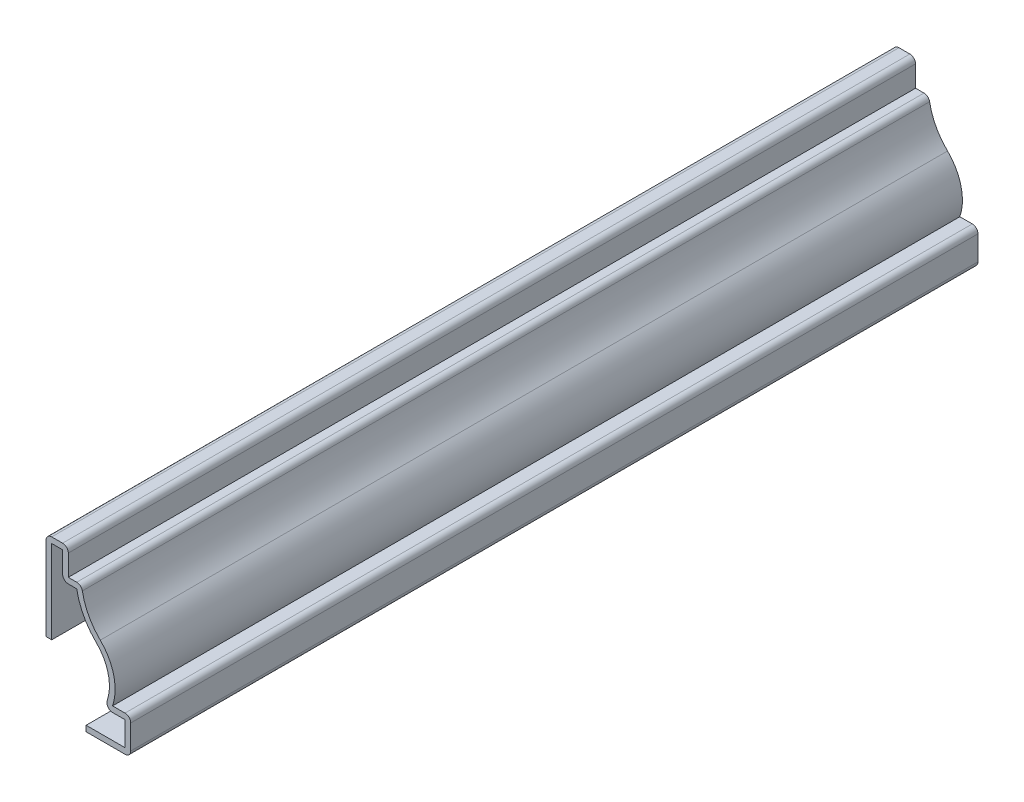
ISO-10303-21;
HEADER;
FILE_DESCRIPTION(('STEP AP214'),'2;1');
FILE_NAME('part.step','',(''),(''),'','','');
FILE_SCHEMA(('AUTOMOTIVE_DESIGN { 1 0 10303 214 1 1 1 1 }'));
ENDSEC;
DATA;
#1=APPLICATION_CONTEXT('core data for automotive mechanical design processes');
#2=APPLICATION_PROTOCOL_DEFINITION('international standard','automotive_design',2000,#1);
#3=PRODUCT_CONTEXT('',#1,'mechanical');
#4=PRODUCT('Part','Part','',(#3));
#5=PRODUCT_RELATED_PRODUCT_CATEGORY('part','',(#4));
#6=PRODUCT_DEFINITION_FORMATION('','',#4);
#7=PRODUCT_DEFINITION_CONTEXT('part definition',#1,'design');
#8=PRODUCT_DEFINITION('design','',#6,#7);
#9=PRODUCT_DEFINITION_SHAPE('','',#8);
#10=(LENGTH_UNIT() NAMED_UNIT(*) SI_UNIT(.MILLI.,.METRE.));
#11=(NAMED_UNIT(*) PLANE_ANGLE_UNIT() SI_UNIT($,.RADIAN.));
#12=(NAMED_UNIT(*) SI_UNIT($,.STERADIAN.) SOLID_ANGLE_UNIT());
#13=UNCERTAINTY_MEASURE_WITH_UNIT(LENGTH_MEASURE(1.E-05),#10,'distance_accuracy_value','');
#14=(GEOMETRIC_REPRESENTATION_CONTEXT(3) GLOBAL_UNCERTAINTY_ASSIGNED_CONTEXT((#13)) GLOBAL_UNIT_ASSIGNED_CONTEXT((#10,
#11,#12)) REPRESENTATION_CONTEXT('',''));
#15=CARTESIAN_POINT('',(0.,0.,0.));
#16=DIRECTION('',(0.,0.,1.));
#17=DIRECTION('',(1.,0.,0.));
#18=AXIS2_PLACEMENT_3D('',#15,#16,#17);
#19=CARTESIAN_POINT('',(4.76250000000001,26.9875,-150.8125));
#20=DIRECTION('',(-1.,0.,0.));
#21=DIRECTION('',(0.,-1.,0.));
#22=AXIS2_PLACEMENT_3D('',#19,#20,#21);
#23=PLANE('',#22);
#24=DIRECTION('',(0.,-1.,0.));
#25=VECTOR('',#24,1.);
#26=CARTESIAN_POINT('',(4.76250000000001,26.9875,0.));
#27=LINE('',#26,#25);
#28=CARTESIAN_POINT('',(4.76250000000001,25.9715,0.));
#29=VERTEX_POINT('',#28);
#30=CARTESIAN_POINT('',(4.76250000000001,11.1125,0.));
#31=VERTEX_POINT('',#30);
#32=EDGE_CURVE('E375',#29,#31,#27,.T.);
#33=ORIENTED_EDGE('',*,*,#32,.F.);
#34=DIRECTION('',(0.,0.,1.));
#35=VECTOR('',#34,1.);
#36=CARTESIAN_POINT('',(4.76250000000001,25.9715,-150.8125));
#37=LINE('',#36,#35);
#38=CARTESIAN_POINT('',(4.76250000000001,25.9715,-150.8125));
#39=VERTEX_POINT('',#38);
#40=EDGE_CURVE('E11',#29,#39,#37,.F.);
#41=ORIENTED_EDGE('',*,*,#40,.T.);
#42=DIRECTION('',(0.,-1.,0.));
#43=VECTOR('',#42,1.);
#44=CARTESIAN_POINT('',(4.76250000000001,26.9875,-150.8125));
#45=LINE('',#44,#43);
#46=CARTESIAN_POINT('',(4.76250000000001,11.1125,-150.8125));
#47=VERTEX_POINT('',#46);
#48=EDGE_CURVE('E215',#39,#47,#45,.T.);
#49=ORIENTED_EDGE('',*,*,#48,.T.);
#50=DIRECTION('',(0.,0.,1.));
#51=VECTOR('',#50,1.);
#52=CARTESIAN_POINT('',(4.76250000000001,11.1125,-150.8125));
#53=LINE('',#52,#51);
#54=EDGE_CURVE('E219',#47,#31,#53,.T.);
#55=ORIENTED_EDGE('',*,*,#54,.T.);
#56=EDGE_LOOP('',(#33,#41,#49,#55));
#57=FACE_BOUND('',#56,.T.);
#58=ADVANCED_FACE('F35',(#57),#23,.T.);
#59=CARTESIAN_POINT('',(8.73125,26.9875,-150.8125));
#60=DIRECTION('',(0.,1.,0.));
#61=DIRECTION('',(0.,0.,1.));
#62=AXIS2_PLACEMENT_3D('',#59,#60,#61);
#63=PLANE('',#62);
#64=DIRECTION('',(-1.,0.,0.));
#65=VECTOR('',#64,1.);
#66=CARTESIAN_POINT('',(8.73125,26.9875,0.));
#67=LINE('',#66,#65);
#68=CARTESIAN_POINT('',(7.71525,26.9875,0.));
#69=VERTEX_POINT('',#68);
#70=CARTESIAN_POINT('',(5.77850000000001,26.9875,0.));
#71=VERTEX_POINT('',#70);
#72=EDGE_CURVE('E224',#69,#71,#67,.T.);
#73=ORIENTED_EDGE('',*,*,#72,.F.);
#74=DIRECTION('',(0.,0.,1.));
#75=VECTOR('',#74,1.);
#76=CARTESIAN_POINT('',(7.71525,26.9875,-150.8125));
#77=LINE('',#76,#75);
#78=CARTESIAN_POINT('',(7.71525,26.9875,-150.8125));
#79=VERTEX_POINT('',#78);
#80=EDGE_CURVE('E43',#69,#79,#77,.F.);
#81=ORIENTED_EDGE('',*,*,#80,.T.);
#82=DIRECTION('',(-1.,0.,0.));
#83=VECTOR('',#82,1.);
#84=CARTESIAN_POINT('',(8.73125,26.9875,-150.8125));
#85=LINE('',#84,#83);
#86=CARTESIAN_POINT('',(5.77850000000001,26.9875,-150.8125));
#87=VERTEX_POINT('',#86);
#88=EDGE_CURVE('E239',#79,#87,#85,.T.);
#89=ORIENTED_EDGE('',*,*,#88,.T.);
#90=DIRECTION('',(0.,0.,1.));
#91=VECTOR('',#90,1.);
#92=CARTESIAN_POINT('',(5.77850000000001,26.9875,-150.8125));
#93=LINE('',#92,#91);
#94=EDGE_CURVE('E303',#87,#71,#93,.T.);
#95=ORIENTED_EDGE('',*,*,#94,.T.);
#96=EDGE_LOOP('',(#73,#81,#89,#95));
#97=FACE_BOUND('',#96,.T.);
#98=ADVANCED_FACE('F309',(#97),#63,.T.);
#99=CARTESIAN_POINT('',(8.73125,22.225,-150.8125));
#100=DIRECTION('',(1.,0.,0.));
#101=DIRECTION('',(0.,0.,-1.));
#102=AXIS2_PLACEMENT_3D('',#99,#100,#101);
#103=PLANE('',#102);
#104=DIRECTION('',(0.,1.,0.));
#105=VECTOR('',#104,1.);
#106=CARTESIAN_POINT('',(8.73125,22.225,-150.8125));
#107=LINE('',#106,#105);
#108=CARTESIAN_POINT('',(8.73125,22.225,-150.8125));
#109=VERTEX_POINT('',#108);
#110=CARTESIAN_POINT('',(8.73125,25.9715,-150.8125));
#111=VERTEX_POINT('',#110);
#112=EDGE_CURVE('E244',#109,#111,#107,.T.);
#113=ORIENTED_EDGE('',*,*,#112,.T.);
#114=DIRECTION('',(0.,0.,1.));
#115=VECTOR('',#114,1.);
#116=CARTESIAN_POINT('',(8.73125,25.9715,-150.8125));
#117=LINE('',#116,#115);
#118=CARTESIAN_POINT('',(8.73125,25.9715,0.));
#119=VERTEX_POINT('',#118);
#120=EDGE_CURVE('E300',#111,#119,#117,.T.);
#121=ORIENTED_EDGE('',*,*,#120,.T.);
#122=DIRECTION('',(0.,1.,0.));
#123=VECTOR('',#122,1.);
#124=CARTESIAN_POINT('',(8.73125,22.225,0.));
#125=LINE('',#124,#123);
#126=CARTESIAN_POINT('',(8.73125,22.225,0.));
#127=VERTEX_POINT('',#126);
#128=EDGE_CURVE('E323',#127,#119,#125,.T.);
#129=ORIENTED_EDGE('',*,*,#128,.F.);
#130=DIRECTION('',(0.,0.,1.));
#131=VECTOR('',#130,1.);
#132=CARTESIAN_POINT('',(8.73125,22.225,-150.8125));
#133=LINE('',#132,#131);
#134=EDGE_CURVE('E252',#109,#127,#133,.T.);
#135=ORIENTED_EDGE('',*,*,#134,.F.);
#136=EDGE_LOOP('',(#113,#121,#129,#135));
#137=FACE_BOUND('',#136,.T.);
#138=ADVANCED_FACE('F321',(#137),#103,.T.);
#139=CARTESIAN_POINT('',(11.1125,22.225,-150.8125));
#140=DIRECTION('',(0.,1.,0.));
#141=DIRECTION('',(0.,0.,1.));
#142=AXIS2_PLACEMENT_3D('',#139,#140,#141);
#143=PLANE('',#142);
#144=DIRECTION('',(-1.,0.,0.));
#145=VECTOR('',#144,1.);
#146=CARTESIAN_POINT('',(11.1125,22.225,0.));
#147=LINE('',#146,#145);
#148=CARTESIAN_POINT('',(10.2303164856225,22.225,0.));
#149=VERTEX_POINT('',#148);
#150=EDGE_CURVE('E328',#149,#127,#147,.T.);
#151=ORIENTED_EDGE('',*,*,#150,.F.);
#152=DIRECTION('',(0.,0.,1.));
#153=VECTOR('',#152,1.);
#154=CARTESIAN_POINT('',(10.2303164856225,22.225,-150.8125));
#155=LINE('',#154,#153);
#156=CARTESIAN_POINT('',(10.2303164856225,22.225,-150.8125));
#157=VERTEX_POINT('',#156);
#158=EDGE_CURVE('E294',#149,#157,#155,.F.);
#159=ORIENTED_EDGE('',*,*,#158,.T.);
#160=DIRECTION('',(-1.,0.,0.));
#161=VECTOR('',#160,1.);
#162=CARTESIAN_POINT('',(11.1125,22.225,-150.8125));
#163=LINE('',#162,#161);
#164=EDGE_CURVE('E421',#157,#109,#163,.T.);
#165=ORIENTED_EDGE('',*,*,#164,.T.);
#166=ORIENTED_EDGE('',*,*,#134,.T.);
#167=EDGE_LOOP('',(#151,#159,#165,#166));
#168=FACE_BOUND('',#167,.T.);
#169=ADVANCED_FACE('F420',(#168),#143,.T.);
#170=CARTESIAN_POINT('',(22.1673258312255,23.3556998236794,-150.8125));
#171=DIRECTION('',(0.,0.,1.));
#172=DIRECTION('',(1.,0.,0.));
#173=AXIS2_PLACEMENT_3D('',#170,#171,#172);
#174=CYLINDRICAL_SURFACE('',#173,11.1125);
#175=CARTESIAN_POINT('',(22.1673258312255,23.3556998236794,-150.8125));
#176=DIRECTION('',(0.,0.,-1.));
#177=DIRECTION('',(-1.,0.,0.));
#178=AXIS2_PLACEMENT_3D('',#175,#176,#177);
#179=CIRCLE('',#178,11.1125);
#180=CARTESIAN_POINT('',(14.4208733657392,15.388257922419,-150.8125));
#181=VERTEX_POINT('',#180);
#182=CARTESIAN_POINT('',(11.2302753836835,21.388828257481,-150.8125));
#183=VERTEX_POINT('',#182);
#184=EDGE_CURVE('E413',#181,#183,#179,.T.);
#185=ORIENTED_EDGE('',*,*,#184,.T.);
#186=DIRECTION('',(0.,0.,1.));
#187=VECTOR('',#186,1.);
#188=CARTESIAN_POINT('',(11.2302753836835,21.388828257481,-150.8125));
#189=LINE('',#188,#187);
#190=CARTESIAN_POINT('',(11.2302753836835,21.388828257481,0.));
#191=VERTEX_POINT('',#190);
#192=EDGE_CURVE('E291',#183,#191,#189,.T.);
#193=ORIENTED_EDGE('',*,*,#192,.T.);
#194=CARTESIAN_POINT('',(22.1673258312255,23.3556998236794,0.));
#195=DIRECTION('',(0.,0.,-1.));
#196=DIRECTION('',(-1.,0.,0.));
#197=AXIS2_PLACEMENT_3D('',#194,#195,#196);
#198=CIRCLE('',#197,11.1125);
#199=CARTESIAN_POINT('',(14.4208733657392,15.388257922419,0.));
#200=VERTEX_POINT('',#199);
#201=EDGE_CURVE('E332',#200,#191,#198,.T.);
#202=ORIENTED_EDGE('',*,*,#201,.F.);
#203=DIRECTION('',(0.,0.,1.));
#204=VECTOR('',#203,1.);
#205=CARTESIAN_POINT('',(14.4208733657392,15.388257922419,-150.8125));
#206=LINE('',#205,#204);
#207=EDGE_CURVE('E337',#181,#200,#206,.T.);
#208=ORIENTED_EDGE('',*,*,#207,.F.);
#209=EDGE_LOOP('',(#185,#193,#202,#208));
#210=FACE_BOUND('',#209,.T.);
#211=ADVANCED_FACE('F410',(#210),#174,.F.);
#212=CARTESIAN_POINT('',(8.334375,9.128125,-150.8125));
#213=DIRECTION('',(0.,0.,1.));
#214=DIRECTION('',(1.,0.,0.));
#215=AXIS2_PLACEMENT_3D('',#212,#213,#214);
#216=CYLINDRICAL_SURFACE('',#215,8.73125);
#217=CARTESIAN_POINT('',(8.334375,9.128125,0.));
#218=DIRECTION('',(0.,0.,1.));
#219=DIRECTION('',(1.,0.,0.));
#220=AXIS2_PLACEMENT_3D('',#217,#218,#219);
#221=CIRCLE('',#220,8.73125);
#222=CARTESIAN_POINT('',(16.6118594033,6.35,0.));
#223=VERTEX_POINT('',#222);
#224=EDGE_CURVE('E403',#223,#200,#221,.T.);
#225=ORIENTED_EDGE('',*,*,#224,.F.);
#226=DIRECTION('',(0.,0.,1.));
#227=VECTOR('',#226,1.);
#228=CARTESIAN_POINT('',(16.6118594033,6.35,-150.8125));
#229=LINE('',#228,#227);
#230=CARTESIAN_POINT('',(16.6118594033,6.35,-150.8125));
#231=VERTEX_POINT('',#230);
#232=EDGE_CURVE('E339',#231,#223,#229,.T.);
#233=ORIENTED_EDGE('',*,*,#232,.F.);
#234=CARTESIAN_POINT('',(8.334375,9.128125,-150.8125));
#235=DIRECTION('',(0.,0.,1.));
#236=DIRECTION('',(1.,0.,0.));
#237=AXIS2_PLACEMENT_3D('',#234,#235,#236);
#238=CIRCLE('',#237,8.73125);
#239=EDGE_CURVE('E424',#231,#181,#238,.T.);
#240=ORIENTED_EDGE('',*,*,#239,.T.);
#241=ORIENTED_EDGE('',*,*,#207,.T.);
#242=EDGE_LOOP('',(#225,#233,#240,#241));
#243=FACE_BOUND('',#242,.T.);
#244=ADVANCED_FACE('F510',(#243),#216,.T.);
#245=CARTESIAN_POINT('',(19.84375,6.35,-150.8125));
#246=DIRECTION('',(0.,1.,0.));
#247=DIRECTION('',(0.,0.,1.));
#248=AXIS2_PLACEMENT_3D('',#245,#246,#247);
#249=PLANE('',#248);
#250=DIRECTION('',(-1.,0.,0.));
#251=VECTOR('',#250,1.);
#252=CARTESIAN_POINT('',(19.84375,6.35,0.));
#253=LINE('',#252,#251);
#254=CARTESIAN_POINT('',(18.82775,6.35,0.));
#255=VERTEX_POINT('',#254);
#256=EDGE_CURVE('E401',#255,#223,#253,.T.);
#257=ORIENTED_EDGE('',*,*,#256,.F.);
#258=DIRECTION('',(0.,0.,1.));
#259=VECTOR('',#258,1.);
#260=CARTESIAN_POINT('',(18.82775,6.35,-150.8125));
#261=LINE('',#260,#259);
#262=CARTESIAN_POINT('',(18.82775,6.35,-150.8125));
#263=VERTEX_POINT('',#262);
#264=EDGE_CURVE('E289',#255,#263,#261,.F.);
#265=ORIENTED_EDGE('',*,*,#264,.T.);
#266=DIRECTION('',(-1.,0.,0.));
#267=VECTOR('',#266,1.);
#268=CARTESIAN_POINT('',(19.84375,6.35,-150.8125));
#269=LINE('',#268,#267);
#270=EDGE_CURVE('E505',#263,#231,#269,.T.);
#271=ORIENTED_EDGE('',*,*,#270,.T.);
#272=ORIENTED_EDGE('',*,*,#232,.T.);
#273=EDGE_LOOP('',(#257,#265,#271,#272));
#274=FACE_BOUND('',#273,.T.);
#275=ADVANCED_FACE('F582',(#274),#249,.T.);
#276=CARTESIAN_POINT('',(19.84375,0.,-150.8125));
#277=DIRECTION('',(1.,0.,0.));
#278=DIRECTION('',(0.,1.,0.));
#279=AXIS2_PLACEMENT_3D('',#276,#277,#278);
#280=PLANE('',#279);
#281=DIRECTION('',(0.,1.,0.));
#282=VECTOR('',#281,1.);
#283=CARTESIAN_POINT('',(19.84375,0.,0.));
#284=LINE('',#283,#282);
#285=CARTESIAN_POINT('',(19.84375,1.016,0.));
#286=VERTEX_POINT('',#285);
#287=CARTESIAN_POINT('',(19.84375,5.334,0.));
#288=VERTEX_POINT('',#287);
#289=EDGE_CURVE('E398',#286,#288,#284,.T.);
#290=ORIENTED_EDGE('',*,*,#289,.F.);
#291=DIRECTION('',(0.,0.,1.));
#292=VECTOR('',#291,1.);
#293=CARTESIAN_POINT('',(19.84375,1.016,-150.8125));
#294=LINE('',#293,#292);
#295=CARTESIAN_POINT('',(19.84375,1.016,-150.8125));
#296=VERTEX_POINT('',#295);
#297=EDGE_CURVE('E287',#286,#296,#294,.F.);
#298=ORIENTED_EDGE('',*,*,#297,.T.);
#299=DIRECTION('',(0.,1.,0.));
#300=VECTOR('',#299,1.);
#301=CARTESIAN_POINT('',(19.84375,0.,-150.8125));
#302=LINE('',#301,#300);
#303=CARTESIAN_POINT('',(19.84375,5.334,-150.8125));
#304=VERTEX_POINT('',#303);
#305=EDGE_CURVE('E502',#296,#304,#302,.T.);
#306=ORIENTED_EDGE('',*,*,#305,.T.);
#307=DIRECTION('',(0.,0.,1.));
#308=VECTOR('',#307,1.);
#309=CARTESIAN_POINT('',(19.84375,5.334,-150.8125));
#310=LINE('',#309,#308);
#311=EDGE_CURVE('E284',#304,#288,#310,.T.);
#312=ORIENTED_EDGE('',*,*,#311,.T.);
#313=EDGE_LOOP('',(#290,#298,#306,#312));
#314=FACE_BOUND('',#313,.T.);
#315=ADVANCED_FACE('F519',(#314),#280,.T.);
#316=CARTESIAN_POINT('',(11.90625,0.,-150.8125));
#317=DIRECTION('',(0.,-1.,0.));
#318=DIRECTION('',(0.,0.,-1.));
#319=AXIS2_PLACEMENT_3D('',#316,#317,#318);
#320=PLANE('',#319);
#321=DIRECTION('',(1.,0.,0.));
#322=VECTOR('',#321,1.);
#323=CARTESIAN_POINT('',(11.90625,0.,-150.8125));
#324=LINE('',#323,#322);
#325=CARTESIAN_POINT('',(11.90625,0.,-150.8125));
#326=VERTEX_POINT('',#325);
#327=CARTESIAN_POINT('',(18.82775,0.,-150.8125));
#328=VERTEX_POINT('',#327);
#329=EDGE_CURVE('E499',#326,#328,#324,.T.);
#330=ORIENTED_EDGE('',*,*,#329,.T.);
#331=DIRECTION('',(0.,0.,1.));
#332=VECTOR('',#331,1.);
#333=CARTESIAN_POINT('',(18.82775,0.,-150.8125));
#334=LINE('',#333,#332);
#335=CARTESIAN_POINT('',(18.82775,0.,0.));
#336=VERTEX_POINT('',#335);
#337=EDGE_CURVE('E281',#328,#336,#334,.T.);
#338=ORIENTED_EDGE('',*,*,#337,.T.);
#339=DIRECTION('',(1.,0.,0.));
#340=VECTOR('',#339,1.);
#341=CARTESIAN_POINT('',(11.90625,0.,0.));
#342=LINE('',#341,#340);
#343=CARTESIAN_POINT('',(11.90625,0.,0.));
#344=VERTEX_POINT('',#343);
#345=EDGE_CURVE('E395',#344,#336,#342,.T.);
#346=ORIENTED_EDGE('',*,*,#345,.F.);
#347=DIRECTION('',(0.,0.,1.));
#348=VECTOR('',#347,1.);
#349=CARTESIAN_POINT('',(11.90625,0.,-150.8125));
#350=LINE('',#349,#348);
#351=EDGE_CURVE('E342',#326,#344,#350,.T.);
#352=ORIENTED_EDGE('',*,*,#351,.F.);
#353=EDGE_LOOP('',(#330,#338,#346,#352));
#354=FACE_BOUND('',#353,.T.);
#355=ADVANCED_FACE('F527',(#354),#320,.T.);
#356=CARTESIAN_POINT('',(11.90625,0.,-150.8125));
#357=DIRECTION('',(1.,0.,0.));
#358=DIRECTION('',(0.,0.,-1.));
#359=AXIS2_PLACEMENT_3D('',#356,#357,#358);
#360=PLANE('',#359);
#361=DIRECTION('',(0.,1.,0.));
#362=VECTOR('',#361,1.);
#363=CARTESIAN_POINT('',(11.90625,0.,0.));
#364=LINE('',#363,#362);
#365=CARTESIAN_POINT('',(11.90625,1.016,0.));
#366=VERTEX_POINT('',#365);
#367=EDGE_CURVE('E393',#344,#366,#364,.T.);
#368=ORIENTED_EDGE('',*,*,#367,.T.);
#369=DIRECTION('',(0.,0.,1.));
#370=VECTOR('',#369,1.);
#371=CARTESIAN_POINT('',(11.90625,1.016,-150.8125));
#372=LINE('',#371,#370);
#373=CARTESIAN_POINT('',(11.90625,1.016,-150.8125));
#374=VERTEX_POINT('',#373);
#375=EDGE_CURVE('E344',#374,#366,#372,.T.);
#376=ORIENTED_EDGE('',*,*,#375,.F.);
#377=DIRECTION('',(0.,1.,0.));
#378=VECTOR('',#377,1.);
#379=CARTESIAN_POINT('',(11.90625,0.,-150.8125));
#380=LINE('',#379,#378);
#381=EDGE_CURVE('E497',#326,#374,#380,.T.);
#382=ORIENTED_EDGE('',*,*,#381,.F.);
#383=ORIENTED_EDGE('',*,*,#351,.T.);
#384=EDGE_LOOP('',(#368,#376,#382,#383));
#385=FACE_BOUND('',#384,.T.);
#386=ADVANCED_FACE('F534',(#385),#360,.F.);
#387=CARTESIAN_POINT('',(11.90625,1.016,-150.8125));
#388=DIRECTION('',(0.,-1.,0.));
#389=DIRECTION('',(0.,0.,-1.));
#390=AXIS2_PLACEMENT_3D('',#387,#388,#389);
#391=PLANE('',#390);
#392=DIRECTION('',(1.,0.,0.));
#393=VECTOR('',#392,1.);
#394=CARTESIAN_POINT('',(11.90625,1.016,0.));
#395=LINE('',#394,#393);
#396=CARTESIAN_POINT('',(18.82775,1.016,0.));
#397=VERTEX_POINT('',#396);
#398=EDGE_CURVE('E391',#366,#397,#395,.T.);
#399=ORIENTED_EDGE('',*,*,#398,.T.);
#400=DIRECTION('',(0.,0.,1.));
#401=VECTOR('',#400,1.);
#402=CARTESIAN_POINT('',(18.82775,1.016,-150.8125));
#403=LINE('',#402,#401);
#404=CARTESIAN_POINT('',(18.82775,1.016,-150.8125));
#405=VERTEX_POINT('',#404);
#406=EDGE_CURVE('E347',#405,#397,#403,.T.);
#407=ORIENTED_EDGE('',*,*,#406,.F.);
#408=DIRECTION('',(1.,0.,0.));
#409=VECTOR('',#408,1.);
#410=CARTESIAN_POINT('',(11.90625,1.016,-150.8125));
#411=LINE('',#410,#409);
#412=EDGE_CURVE('E491',#374,#405,#411,.T.);
#413=ORIENTED_EDGE('',*,*,#412,.F.);
#414=ORIENTED_EDGE('',*,*,#375,.T.);
#415=EDGE_LOOP('',(#399,#407,#413,#414));
#416=FACE_BOUND('',#415,.T.);
#417=ADVANCED_FACE('F537',(#416),#391,.F.);
#418=CARTESIAN_POINT('',(18.82775,0.,-150.8125));
#419=DIRECTION('',(1.,0.,0.));
#420=DIRECTION('',(0.,1.,0.));
#421=AXIS2_PLACEMENT_3D('',#418,#419,#420);
#422=PLANE('',#421);
#423=DIRECTION('',(0.,1.,0.));
#424=VECTOR('',#423,1.);
#425=CARTESIAN_POINT('',(18.82775,0.,0.));
#426=LINE('',#425,#424);
#427=CARTESIAN_POINT('',(18.82775,5.334,0.));
#428=VERTEX_POINT('',#427);
#429=EDGE_CURVE('E389',#397,#428,#426,.T.);
#430=ORIENTED_EDGE('',*,*,#429,.T.);
#431=DIRECTION('',(0.,0.,1.));
#432=VECTOR('',#431,1.);
#433=CARTESIAN_POINT('',(18.82775,5.334,-150.8125));
#434=LINE('',#433,#432);
#435=CARTESIAN_POINT('',(18.82775,5.334,-150.8125));
#436=VERTEX_POINT('',#435);
#437=EDGE_CURVE('E350',#436,#428,#434,.T.);
#438=ORIENTED_EDGE('',*,*,#437,.F.);
#439=DIRECTION('',(0.,1.,0.));
#440=VECTOR('',#439,1.);
#441=CARTESIAN_POINT('',(18.82775,0.,-150.8125));
#442=LINE('',#441,#440);
#443=EDGE_CURVE('E488',#405,#436,#442,.T.);
#444=ORIENTED_EDGE('',*,*,#443,.F.);
#445=ORIENTED_EDGE('',*,*,#406,.T.);
#446=EDGE_LOOP('',(#430,#438,#444,#445));
#447=FACE_BOUND('',#446,.T.);
#448=ADVANCED_FACE('F540',(#447),#422,.F.);
#449=CARTESIAN_POINT('',(19.84375,5.334,-150.8125));
#450=DIRECTION('',(0.,1.,0.));
#451=DIRECTION('',(0.,0.,1.));
#452=AXIS2_PLACEMENT_3D('',#449,#450,#451);
#453=PLANE('',#452);
#454=DIRECTION('',(1.,0.,0.));
#455=VECTOR('',#454,1.);
#456=CARTESIAN_POINT('',(19.84375,5.334,0.));
#457=LINE('',#456,#455);
#458=CARTESIAN_POINT('',(16.6118594033,5.334,0.));
#459=VERTEX_POINT('',#458);
#460=EDGE_CURVE('E386',#428,#459,#457,.F.);
#461=ORIENTED_EDGE('',*,*,#460,.T.);
#462=DIRECTION('',(0.,0.,1.));
#463=VECTOR('',#462,1.);
#464=CARTESIAN_POINT('',(16.6118594033,5.334,-150.8125));
#465=LINE('',#464,#463);
#466=CARTESIAN_POINT('',(16.6118594033,5.334,-150.8125));
#467=VERTEX_POINT('',#466);
#468=EDGE_CURVE('E266',#459,#467,#465,.F.);
#469=ORIENTED_EDGE('',*,*,#468,.T.);
#470=DIRECTION('',(1.,0.,0.));
#471=VECTOR('',#470,1.);
#472=CARTESIAN_POINT('',(19.84375,5.334,-150.8125));
#473=LINE('',#472,#471);
#474=EDGE_CURVE('E486',#436,#467,#473,.F.);
#475=ORIENTED_EDGE('',*,*,#474,.F.);
#476=ORIENTED_EDGE('',*,*,#437,.T.);
#477=EDGE_LOOP('',(#461,#469,#475,#476));
#478=FACE_BOUND('',#477,.T.);
#479=ADVANCED_FACE('F485',(#478),#453,.F.);
#480=CARTESIAN_POINT('',(8.334375,9.128125,-150.8125));
#481=DIRECTION('',(0.,0.,1.));
#482=DIRECTION('',(1.,0.,0.));
#483=AXIS2_PLACEMENT_3D('',#480,#481,#482);
#484=CYLINDRICAL_SURFACE('',#483,7.71525);
#485=CARTESIAN_POINT('',(8.334375,9.128125,-150.8125));
#486=DIRECTION('',(0.,0.,1.));
#487=DIRECTION('',(1.,0.,0.));
#488=AXIS2_PLACEMENT_3D('',#485,#486,#487);
#489=CIRCLE('',#488,7.71525);
#490=CARTESIAN_POINT('',(15.6486612181887,6.67327272727273,-150.8125));
#491=VERTEX_POINT('',#490);
#492=CARTESIAN_POINT('',(13.7126262831805,14.6598060914466,-150.8125));
#493=VERTEX_POINT('',#492);
#494=EDGE_CURVE('E480',#491,#493,#489,.T.);
#495=ORIENTED_EDGE('',*,*,#494,.F.);
#496=DIRECTION('',(0.,0.,1.));
#497=VECTOR('',#496,1.);
#498=CARTESIAN_POINT('',(15.6486612181887,6.67327272727273,-150.8125));
#499=LINE('',#498,#497);
#500=CARTESIAN_POINT('',(15.6486612181887,6.67327272727273,0.));
#501=VERTEX_POINT('',#500);
#502=EDGE_CURVE('E248',#491,#501,#499,.T.);
#503=ORIENTED_EDGE('',*,*,#502,.T.);
#504=CARTESIAN_POINT('',(8.334375,9.128125,0.));
#505=DIRECTION('',(0.,0.,1.));
#506=DIRECTION('',(1.,0.,0.));
#507=AXIS2_PLACEMENT_3D('',#504,#505,#506);
#508=CIRCLE('',#507,7.71525);
#509=CARTESIAN_POINT('',(13.7126262831805,14.6598060914466,0.));
#510=VERTEX_POINT('',#509);
#511=EDGE_CURVE('E384',#501,#510,#508,.T.);
#512=ORIENTED_EDGE('',*,*,#511,.T.);
#513=DIRECTION('',(0.,0.,1.));
#514=VECTOR('',#513,1.);
#515=CARTESIAN_POINT('',(13.7126262831805,14.6598060914466,-150.8125));
#516=LINE('',#515,#514);
#517=EDGE_CURVE('E353',#493,#510,#516,.T.);
#518=ORIENTED_EDGE('',*,*,#517,.F.);
#519=EDGE_LOOP('',(#495,#503,#512,#518));
#520=FACE_BOUND('',#519,.T.);
#521=ADVANCED_FACE('F478',(#520),#484,.F.);
#522=CARTESIAN_POINT('',(22.1673258312255,23.3556998236794,-150.8125));
#523=DIRECTION('',(0.,0.,1.));
#524=DIRECTION('',(1.,0.,0.));
#525=AXIS2_PLACEMENT_3D('',#522,#523,#524);
#526=CYLINDRICAL_SURFACE('',#525,12.1285);
#527=CARTESIAN_POINT('',(22.1673258312255,23.3556998236794,0.));
#528=DIRECTION('',(0.,0.,1.));
#529=DIRECTION('',(1.,0.,0.));
#530=AXIS2_PLACEMENT_3D('',#527,#528,#529);
#531=CIRCLE('',#530,12.1285);
#532=CARTESIAN_POINT('',(10.2303164856225,21.209,0.));
#533=VERTEX_POINT('',#532);
#534=EDGE_CURVE('E382',#510,#533,#531,.F.);
#535=ORIENTED_EDGE('',*,*,#534,.T.);
#536=DIRECTION('',(0.,0.,1.));
#537=VECTOR('',#536,1.);
#538=CARTESIAN_POINT('',(10.2303164856225,21.209,-150.8125));
#539=LINE('',#538,#537);
#540=CARTESIAN_POINT('',(10.2303164856225,21.209,-150.8125));
#541=VERTEX_POINT('',#540);
#542=EDGE_CURVE('E356',#541,#533,#539,.T.);
#543=ORIENTED_EDGE('',*,*,#542,.F.);
#544=CARTESIAN_POINT('',(22.1673258312255,23.3556998236794,-150.8125));
#545=DIRECTION('',(0.,0.,1.));
#546=DIRECTION('',(1.,0.,0.));
#547=AXIS2_PLACEMENT_3D('',#544,#545,#546);
#548=CIRCLE('',#547,12.1285);
#549=EDGE_CURVE('E473',#493,#541,#548,.F.);
#550=ORIENTED_EDGE('',*,*,#549,.F.);
#551=ORIENTED_EDGE('',*,*,#517,.T.);
#552=EDGE_LOOP('',(#535,#543,#550,#551));
#553=FACE_BOUND('',#552,.T.);
#554=ADVANCED_FACE('F472',(#553),#526,.T.);
#555=CARTESIAN_POINT('',(11.1125,21.209,-150.8125));
#556=DIRECTION('',(0.,1.,0.));
#557=DIRECTION('',(0.,0.,1.));
#558=AXIS2_PLACEMENT_3D('',#555,#556,#557);
#559=PLANE('',#558);
#560=DIRECTION('',(1.,0.,0.));
#561=VECTOR('',#560,1.);
#562=CARTESIAN_POINT('',(11.1125,21.209,0.));
#563=LINE('',#562,#561);
#564=CARTESIAN_POINT('',(8.73125,21.209,0.));
#565=VERTEX_POINT('',#564);
#566=EDGE_CURVE('E380',#533,#565,#563,.F.);
#567=ORIENTED_EDGE('',*,*,#566,.T.);
#568=DIRECTION('',(0.,0.,1.));
#569=VECTOR('',#568,1.);
#570=CARTESIAN_POINT('',(8.73125,21.209,-150.8125));
#571=LINE('',#570,#569);
#572=CARTESIAN_POINT('',(8.73125,21.209,-150.8125));
#573=VERTEX_POINT('',#572);
#574=EDGE_CURVE('E58',#565,#573,#571,.F.);
#575=ORIENTED_EDGE('',*,*,#574,.T.);
#576=DIRECTION('',(1.,0.,0.));
#577=VECTOR('',#576,1.);
#578=CARTESIAN_POINT('',(11.1125,21.209,-150.8125));
#579=LINE('',#578,#577);
#580=EDGE_CURVE('E469',#541,#573,#579,.F.);
#581=ORIENTED_EDGE('',*,*,#580,.F.);
#582=ORIENTED_EDGE('',*,*,#542,.T.);
#583=EDGE_LOOP('',(#567,#575,#581,#582));
#584=FACE_BOUND('',#583,.T.);
#585=ADVANCED_FACE('F467',(#584),#559,.F.);
#586=CARTESIAN_POINT('',(7.71525,22.225,-150.8125));
#587=DIRECTION('',(1.,0.,0.));
#588=DIRECTION('',(0.,0.,-1.));
#589=AXIS2_PLACEMENT_3D('',#586,#587,#588);
#590=PLANE('',#589);
#591=DIRECTION('',(0.,1.,0.));
#592=VECTOR('',#591,1.);
#593=CARTESIAN_POINT('',(7.71525,22.225,-150.8125));
#594=LINE('',#593,#592);
#595=CARTESIAN_POINT('',(7.71525,22.225,-150.8125));
#596=VERTEX_POINT('',#595);
#597=CARTESIAN_POINT('',(7.71525,25.9715,-150.8125));
#598=VERTEX_POINT('',#597);
#599=EDGE_CURVE('E464',#596,#598,#594,.T.);
#600=ORIENTED_EDGE('',*,*,#599,.F.);
#601=DIRECTION('',(0.,0.,1.));
#602=VECTOR('',#601,1.);
#603=CARTESIAN_POINT('',(7.71525,22.225,-150.8125));
#604=LINE('',#603,#602);
#605=CARTESIAN_POINT('',(7.71525,22.225,0.));
#606=VERTEX_POINT('',#605);
#607=EDGE_CURVE('E296',#596,#606,#604,.T.);
#608=ORIENTED_EDGE('',*,*,#607,.T.);
#609=DIRECTION('',(0.,1.,0.));
#610=VECTOR('',#609,1.);
#611=CARTESIAN_POINT('',(7.71525,22.225,0.));
#612=LINE('',#611,#610);
#613=CARTESIAN_POINT('',(7.71525,25.9715,0.));
#614=VERTEX_POINT('',#613);
#615=EDGE_CURVE('E373',#606,#614,#612,.T.);
#616=ORIENTED_EDGE('',*,*,#615,.T.);
#617=DIRECTION('',(0.,0.,1.));
#618=VECTOR('',#617,1.);
#619=CARTESIAN_POINT('',(7.71525,25.9715,-150.8125));
#620=LINE('',#619,#618);
#621=EDGE_CURVE('E359',#598,#614,#620,.T.);
#622=ORIENTED_EDGE('',*,*,#621,.F.);
#623=EDGE_LOOP('',(#600,#608,#616,#622));
#624=FACE_BOUND('',#623,.T.);
#625=ADVANCED_FACE('F462',(#624),#590,.F.);
#626=CARTESIAN_POINT('',(8.73125,25.9715,-150.8125));
#627=DIRECTION('',(0.,1.,0.));
#628=DIRECTION('',(0.,0.,1.));
#629=AXIS2_PLACEMENT_3D('',#626,#627,#628);
#630=PLANE('',#629);
#631=DIRECTION('',(1.,0.,0.));
#632=VECTOR('',#631,1.);
#633=CARTESIAN_POINT('',(8.73125,25.9715,0.));
#634=LINE('',#633,#632);
#635=CARTESIAN_POINT('',(5.77850000000001,25.9715,0.));
#636=VERTEX_POINT('',#635);
#637=EDGE_CURVE('E371',#614,#636,#634,.F.);
#638=ORIENTED_EDGE('',*,*,#637,.T.);
#639=DIRECTION('',(0.,0.,1.));
#640=VECTOR('',#639,1.);
#641=CARTESIAN_POINT('',(5.77850000000001,25.9715,-150.8125));
#642=LINE('',#641,#640);
#643=CARTESIAN_POINT('',(5.77850000000001,25.9715,-150.8125));
#644=VERTEX_POINT('',#643);
#645=EDGE_CURVE('E241',#644,#636,#642,.T.);
#646=ORIENTED_EDGE('',*,*,#645,.F.);
#647=DIRECTION('',(1.,0.,0.));
#648=VECTOR('',#647,1.);
#649=CARTESIAN_POINT('',(8.73125,25.9715,-150.8125));
#650=LINE('',#649,#648);
#651=EDGE_CURVE('E751',#598,#644,#650,.F.);
#652=ORIENTED_EDGE('',*,*,#651,.F.);
#653=ORIENTED_EDGE('',*,*,#621,.T.);
#654=EDGE_LOOP('',(#638,#646,#652,#653));
#655=FACE_BOUND('',#654,.T.);
#656=ADVANCED_FACE('F559',(#655),#630,.F.);
#657=CARTESIAN_POINT('',(5.77850000000001,26.9875,-150.8125));
#658=DIRECTION('',(-1.,0.,0.));
#659=DIRECTION('',(0.,-1.,0.));
#660=AXIS2_PLACEMENT_3D('',#657,#658,#659);
#661=PLANE('',#660);
#662=DIRECTION('',(0.,-1.,0.));
#663=VECTOR('',#662,1.);
#664=CARTESIAN_POINT('',(5.77850000000001,26.9875,0.));
#665=LINE('',#664,#663);
#666=CARTESIAN_POINT('',(5.77850000000001,11.1125,0.));
#667=VERTEX_POINT('',#666);
#668=EDGE_CURVE('E366',#636,#667,#665,.T.);
#669=ORIENTED_EDGE('',*,*,#668,.T.);
#670=DIRECTION('',(0.,0.,1.));
#671=VECTOR('',#670,1.);
#672=CARTESIAN_POINT('',(5.77850000000001,11.1125,-150.8125));
#673=LINE('',#672,#671);
#674=CARTESIAN_POINT('',(5.77850000000001,11.1125,-150.8125));
#675=VERTEX_POINT('',#674);
#676=EDGE_CURVE('E238',#675,#667,#673,.T.);
#677=ORIENTED_EDGE('',*,*,#676,.F.);
#678=DIRECTION('',(0.,-1.,0.));
#679=VECTOR('',#678,1.);
#680=CARTESIAN_POINT('',(5.77850000000001,26.9875,-150.8125));
#681=LINE('',#680,#679);
#682=EDGE_CURVE('E230',#644,#675,#681,.T.);
#683=ORIENTED_EDGE('',*,*,#682,.F.);
#684=ORIENTED_EDGE('',*,*,#645,.T.);
#685=EDGE_LOOP('',(#669,#677,#683,#684));
#686=FACE_BOUND('',#685,.T.);
#687=ADVANCED_FACE('F365',(#686),#661,.F.);
#688=CARTESIAN_POINT('',(5.77850000000001,11.1125,-150.8125));
#689=DIRECTION('',(0.,1.,0.));
#690=DIRECTION('',(0.,0.,1.));
#691=AXIS2_PLACEMENT_3D('',#688,#689,#690);
#692=PLANE('',#691);
#693=DIRECTION('',(-1.,0.,0.));
#694=VECTOR('',#693,1.);
#695=CARTESIAN_POINT('',(5.77850000000001,11.1125,0.));
#696=LINE('',#695,#694);
#697=EDGE_CURVE('E237',#667,#31,#696,.T.);
#698=ORIENTED_EDGE('',*,*,#697,.T.);
#699=ORIENTED_EDGE('',*,*,#54,.F.);
#700=DIRECTION('',(-1.,0.,0.));
#701=VECTOR('',#700,1.);
#702=CARTESIAN_POINT('',(5.77850000000001,11.1125,-150.8125));
#703=LINE('',#702,#701);
#704=EDGE_CURVE('E223',#675,#47,#703,.T.);
#705=ORIENTED_EDGE('',*,*,#704,.F.);
#706=ORIENTED_EDGE('',*,*,#676,.T.);
#707=EDGE_LOOP('',(#698,#699,#705,#706));
#708=FACE_BOUND('',#707,.T.);
#709=ADVANCED_FACE('F235',(#708),#692,.F.);
#710=CARTESIAN_POINT('',(22.1673258312255,23.3556998236794,-150.8125));
#711=DIRECTION('',(0.,0.,1.));
#712=DIRECTION('',(1.,0.,0.));
#713=AXIS2_PLACEMENT_3D('',#710,#711,#712);
#714=PLANE('',#713);
#715=ORIENTED_EDGE('',*,*,#474,.T.);
#716=CARTESIAN_POINT('',(16.6118594033,6.35,-150.8125));
#717=DIRECTION('',(0.,0.,1.));
#718=DIRECTION('',(1.,0.,0.));
#719=AXIS2_PLACEMENT_3D('',#716,#717,#718);
#720=CIRCLE('',#719,1.016);
#721=EDGE_CURVE('E279',#467,#491,#720,.F.);
#722=ORIENTED_EDGE('',*,*,#721,.T.);
#723=ORIENTED_EDGE('',*,*,#494,.T.);
#724=ORIENTED_EDGE('',*,*,#549,.T.);
#725=ORIENTED_EDGE('',*,*,#580,.T.);
#726=CARTESIAN_POINT('',(8.73125,22.225,-150.8125));
#727=DIRECTION('',(0.,0.,1.));
#728=DIRECTION('',(1.,0.,0.));
#729=AXIS2_PLACEMENT_3D('',#726,#727,#728);
#730=CIRCLE('',#729,1.016);
#731=EDGE_CURVE('E50',#573,#596,#730,.F.);
#732=ORIENTED_EDGE('',*,*,#731,.T.);
#733=ORIENTED_EDGE('',*,*,#599,.T.);
#734=ORIENTED_EDGE('',*,*,#651,.T.);
#735=ORIENTED_EDGE('',*,*,#682,.T.);
#736=ORIENTED_EDGE('',*,*,#704,.T.);
#737=ORIENTED_EDGE('',*,*,#48,.F.);
#738=CARTESIAN_POINT('',(5.77850000000001,25.9715,-150.8125));
#739=DIRECTION('',(0.,0.,1.));
#740=DIRECTION('',(1.,0.,0.));
#741=AXIS2_PLACEMENT_3D('',#738,#739,#740);
#742=CIRCLE('',#741,1.016);
#743=EDGE_CURVE('E268',#39,#87,#742,.F.);
#744=ORIENTED_EDGE('',*,*,#743,.T.);
#745=ORIENTED_EDGE('',*,*,#88,.F.);
#746=CARTESIAN_POINT('',(7.71525,25.9715,-150.8125));
#747=DIRECTION('',(0.,0.,1.));
#748=DIRECTION('',(1.,0.,0.));
#749=AXIS2_PLACEMENT_3D('',#746,#747,#748);
#750=CIRCLE('',#749,1.016);
#751=EDGE_CURVE('E270',#79,#111,#750,.F.);
#752=ORIENTED_EDGE('',*,*,#751,.T.);
#753=ORIENTED_EDGE('',*,*,#112,.F.);
#754=ORIENTED_EDGE('',*,*,#164,.F.);
#755=CARTESIAN_POINT('',(10.2303164856225,21.209,-150.8125));
#756=DIRECTION('',(0.,0.,1.));
#757=DIRECTION('',(1.,0.,0.));
#758=AXIS2_PLACEMENT_3D('',#755,#756,#757);
#759=CIRCLE('',#758,1.016);
#760=EDGE_CURVE('E273',#157,#183,#759,.F.);
#761=ORIENTED_EDGE('',*,*,#760,.T.);
#762=ORIENTED_EDGE('',*,*,#184,.F.);
#763=ORIENTED_EDGE('',*,*,#239,.F.);
#764=ORIENTED_EDGE('',*,*,#270,.F.);
#765=CARTESIAN_POINT('',(18.82775,5.334,-150.8125));
#766=DIRECTION('',(0.,0.,1.));
#767=DIRECTION('',(1.,0.,0.));
#768=AXIS2_PLACEMENT_3D('',#765,#766,#767);
#769=CIRCLE('',#768,1.016);
#770=EDGE_CURVE('E275',#263,#304,#769,.F.);
#771=ORIENTED_EDGE('',*,*,#770,.T.);
#772=ORIENTED_EDGE('',*,*,#305,.F.);
#773=CARTESIAN_POINT('',(18.82775,1.016,-150.8125));
#774=DIRECTION('',(0.,0.,1.));
#775=DIRECTION('',(1.,0.,0.));
#776=AXIS2_PLACEMENT_3D('',#773,#774,#775);
#777=CIRCLE('',#776,1.016);
#778=EDGE_CURVE('E277',#296,#328,#777,.F.);
#779=ORIENTED_EDGE('',*,*,#778,.T.);
#780=ORIENTED_EDGE('',*,*,#329,.F.);
#781=ORIENTED_EDGE('',*,*,#381,.T.);
#782=ORIENTED_EDGE('',*,*,#412,.T.);
#783=ORIENTED_EDGE('',*,*,#443,.T.);
#784=EDGE_LOOP('',(#715,#722,#723,#724,#725,#732,#733,#734,#735,#736,#737,#744,#745,#752,#753,
#754,#761,#762,#763,#764,#771,#772,#779,#780,#781,#782,#783));
#785=FACE_BOUND('',#784,.T.);
#786=ADVANCED_FACE('F228',(#785),#714,.F.);
#787=CARTESIAN_POINT('',(22.1673258312255,23.3556998236794,0.));
#788=DIRECTION('',(0.,0.,1.));
#789=DIRECTION('',(1.,0.,0.));
#790=AXIS2_PLACEMENT_3D('',#787,#788,#789);
#791=PLANE('',#790);
#792=ORIENTED_EDGE('',*,*,#511,.F.);
#793=CARTESIAN_POINT('',(16.6118594033,6.35,0.));
#794=DIRECTION('',(0.,0.,1.));
#795=DIRECTION('',(1.,0.,0.));
#796=AXIS2_PLACEMENT_3D('',#793,#794,#795);
#797=CIRCLE('',#796,1.016);
#798=EDGE_CURVE('E264',#501,#459,#797,.T.);
#799=ORIENTED_EDGE('',*,*,#798,.T.);
#800=ORIENTED_EDGE('',*,*,#460,.F.);
#801=ORIENTED_EDGE('',*,*,#429,.F.);
#802=ORIENTED_EDGE('',*,*,#398,.F.);
#803=ORIENTED_EDGE('',*,*,#367,.F.);
#804=ORIENTED_EDGE('',*,*,#345,.T.);
#805=CARTESIAN_POINT('',(18.82775,1.016,0.));
#806=DIRECTION('',(0.,0.,1.));
#807=DIRECTION('',(1.,0.,0.));
#808=AXIS2_PLACEMENT_3D('',#805,#806,#807);
#809=CIRCLE('',#808,1.016);
#810=EDGE_CURVE('E262',#336,#286,#809,.T.);
#811=ORIENTED_EDGE('',*,*,#810,.T.);
#812=ORIENTED_EDGE('',*,*,#289,.T.);
#813=CARTESIAN_POINT('',(18.82775,5.334,0.));
#814=DIRECTION('',(0.,0.,1.));
#815=DIRECTION('',(1.,0.,0.));
#816=AXIS2_PLACEMENT_3D('',#813,#814,#815);
#817=CIRCLE('',#816,1.016);
#818=EDGE_CURVE('E260',#288,#255,#817,.T.);
#819=ORIENTED_EDGE('',*,*,#818,.T.);
#820=ORIENTED_EDGE('',*,*,#256,.T.);
#821=ORIENTED_EDGE('',*,*,#224,.T.);
#822=ORIENTED_EDGE('',*,*,#201,.T.);
#823=CARTESIAN_POINT('',(10.2303164856225,21.209,0.));
#824=DIRECTION('',(0.,0.,1.));
#825=DIRECTION('',(1.,0.,0.));
#826=AXIS2_PLACEMENT_3D('',#823,#824,#825);
#827=CIRCLE('',#826,1.016);
#828=EDGE_CURVE('E258',#191,#149,#827,.T.);
#829=ORIENTED_EDGE('',*,*,#828,.T.);
#830=ORIENTED_EDGE('',*,*,#150,.T.);
#831=ORIENTED_EDGE('',*,*,#128,.T.);
#832=CARTESIAN_POINT('',(7.71525,25.9715,0.));
#833=DIRECTION('',(0.,0.,1.));
#834=DIRECTION('',(1.,0.,0.));
#835=AXIS2_PLACEMENT_3D('',#832,#833,#834);
#836=CIRCLE('',#835,1.016);
#837=EDGE_CURVE('E254',#119,#69,#836,.T.);
#838=ORIENTED_EDGE('',*,*,#837,.T.);
#839=ORIENTED_EDGE('',*,*,#72,.T.);
#840=CARTESIAN_POINT('',(5.77850000000001,25.9715,0.));
#841=DIRECTION('',(0.,0.,1.));
#842=DIRECTION('',(1.,0.,0.));
#843=AXIS2_PLACEMENT_3D('',#840,#841,#842);
#844=CIRCLE('',#843,1.016);
#845=EDGE_CURVE('E251',#71,#29,#844,.T.);
#846=ORIENTED_EDGE('',*,*,#845,.T.);
#847=ORIENTED_EDGE('',*,*,#32,.T.);
#848=ORIENTED_EDGE('',*,*,#697,.F.);
#849=ORIENTED_EDGE('',*,*,#668,.F.);
#850=ORIENTED_EDGE('',*,*,#637,.F.);
#851=ORIENTED_EDGE('',*,*,#615,.F.);
#852=CARTESIAN_POINT('',(8.73125,22.225,0.));
#853=DIRECTION('',(0.,0.,1.));
#854=DIRECTION('',(1.,0.,0.));
#855=AXIS2_PLACEMENT_3D('',#852,#853,#854);
#856=CIRCLE('',#855,1.016);
#857=EDGE_CURVE('E256',#606,#565,#856,.T.);
#858=ORIENTED_EDGE('',*,*,#857,.T.);
#859=ORIENTED_EDGE('',*,*,#566,.F.);
#860=ORIENTED_EDGE('',*,*,#534,.F.);
#861=EDGE_LOOP('',(#792,#799,#800,#801,#802,#803,#804,#811,#812,#819,#820,#821,#822,#829,#830,
#831,#838,#839,#846,#847,#848,#849,#850,#851,#858,#859,#860));
#862=FACE_BOUND('',#861,.T.);
#863=ADVANCED_FACE('F326',(#862),#791,.T.);
#864=CARTESIAN_POINT('',(16.6118594033,6.35,-150.8125));
#865=DIRECTION('',(0.,0.,1.));
#866=DIRECTION('',(1.,0.,0.));
#867=AXIS2_PLACEMENT_3D('',#864,#865,#866);
#868=CYLINDRICAL_SURFACE('',#867,1.016);
#869=ORIENTED_EDGE('',*,*,#721,.F.);
#870=ORIENTED_EDGE('',*,*,#468,.F.);
#871=ORIENTED_EDGE('',*,*,#798,.F.);
#872=ORIENTED_EDGE('',*,*,#502,.F.);
#873=EDGE_LOOP('',(#869,#870,#871,#872));
#874=FACE_BOUND('',#873,.T.);
#875=ADVANCED_FACE('F442',(#874),#868,.T.);
#876=CARTESIAN_POINT('',(18.82775,1.016,-150.8125));
#877=DIRECTION('',(0.,0.,1.));
#878=DIRECTION('',(1.,0.,0.));
#879=AXIS2_PLACEMENT_3D('',#876,#877,#878);
#880=CYLINDRICAL_SURFACE('',#879,1.016);
#881=ORIENTED_EDGE('',*,*,#778,.F.);
#882=ORIENTED_EDGE('',*,*,#297,.F.);
#883=ORIENTED_EDGE('',*,*,#810,.F.);
#884=ORIENTED_EDGE('',*,*,#337,.F.);
#885=EDGE_LOOP('',(#881,#882,#883,#884));
#886=FACE_BOUND('',#885,.T.);
#887=ADVANCED_FACE('F445',(#886),#880,.T.);
#888=CARTESIAN_POINT('',(18.82775,5.334,-150.8125));
#889=DIRECTION('',(0.,0.,1.));
#890=DIRECTION('',(1.,0.,0.));
#891=AXIS2_PLACEMENT_3D('',#888,#889,#890);
#892=CYLINDRICAL_SURFACE('',#891,1.016);
#893=ORIENTED_EDGE('',*,*,#770,.F.);
#894=ORIENTED_EDGE('',*,*,#264,.F.);
#895=ORIENTED_EDGE('',*,*,#818,.F.);
#896=ORIENTED_EDGE('',*,*,#311,.F.);
#897=EDGE_LOOP('',(#893,#894,#895,#896));
#898=FACE_BOUND('',#897,.T.);
#899=ADVANCED_FACE('F449',(#898),#892,.T.);
#900=CARTESIAN_POINT('',(10.2303164856225,21.209,-150.8125));
#901=DIRECTION('',(0.,0.,1.));
#902=DIRECTION('',(1.,0.,0.));
#903=AXIS2_PLACEMENT_3D('',#900,#901,#902);
#904=CYLINDRICAL_SURFACE('',#903,1.016);
#905=ORIENTED_EDGE('',*,*,#760,.F.);
#906=ORIENTED_EDGE('',*,*,#158,.F.);
#907=ORIENTED_EDGE('',*,*,#828,.F.);
#908=ORIENTED_EDGE('',*,*,#192,.F.);
#909=EDGE_LOOP('',(#905,#906,#907,#908));
#910=FACE_BOUND('',#909,.T.);
#911=ADVANCED_FACE('F416',(#910),#904,.T.);
#912=CARTESIAN_POINT('',(8.73125,22.225,-150.8125));
#913=DIRECTION('',(0.,0.,1.));
#914=DIRECTION('',(1.,0.,0.));
#915=AXIS2_PLACEMENT_3D('',#912,#913,#914);
#916=CYLINDRICAL_SURFACE('',#915,1.016);
#917=ORIENTED_EDGE('',*,*,#731,.F.);
#918=ORIENTED_EDGE('',*,*,#574,.F.);
#919=ORIENTED_EDGE('',*,*,#857,.F.);
#920=ORIENTED_EDGE('',*,*,#607,.F.);
#921=EDGE_LOOP('',(#917,#918,#919,#920));
#922=FACE_BOUND('',#921,.T.);
#923=ADVANCED_FACE('F432',(#922),#916,.T.);
#924=CARTESIAN_POINT('',(7.71525,25.9715,-150.8125));
#925=DIRECTION('',(0.,0.,1.));
#926=DIRECTION('',(1.,0.,0.));
#927=AXIS2_PLACEMENT_3D('',#924,#925,#926);
#928=CYLINDRICAL_SURFACE('',#927,1.016);
#929=ORIENTED_EDGE('',*,*,#751,.F.);
#930=ORIENTED_EDGE('',*,*,#80,.F.);
#931=ORIENTED_EDGE('',*,*,#837,.F.);
#932=ORIENTED_EDGE('',*,*,#120,.F.);
#933=EDGE_LOOP('',(#929,#930,#931,#932));
#934=FACE_BOUND('',#933,.T.);
#935=ADVANCED_FACE('F317',(#934),#928,.T.);
#936=CARTESIAN_POINT('',(5.77850000000001,25.9715,-150.8125));
#937=DIRECTION('',(0.,0.,1.));
#938=DIRECTION('',(1.,0.,0.));
#939=AXIS2_PLACEMENT_3D('',#936,#937,#938);
#940=CYLINDRICAL_SURFACE('',#939,1.016);
#941=ORIENTED_EDGE('',*,*,#743,.F.);
#942=ORIENTED_EDGE('',*,*,#40,.F.);
#943=ORIENTED_EDGE('',*,*,#845,.F.);
#944=ORIENTED_EDGE('',*,*,#94,.F.);
#945=EDGE_LOOP('',(#941,#942,#943,#944));
#946=FACE_BOUND('',#945,.T.);
#947=ADVANCED_FACE('F37',(#946),#940,.T.);
#948=CLOSED_SHELL('',(#58,#98,#138,#169,#211,#244,#275,#315,#355,#386,#417,#448,#479,#521,#554,
#585,#625,#656,#687,#709,#786,#863,#875,#887,#899,#911,#923,#935,#947));
#949=MANIFOLD_SOLID_BREP('B2',#948);
#950=ADVANCED_BREP_SHAPE_REPRESENTATION('',(#18,#949),#14);
#951=SHAPE_DEFINITION_REPRESENTATION(#9,#950);
ENDSEC;
END-ISO-10303-21;
